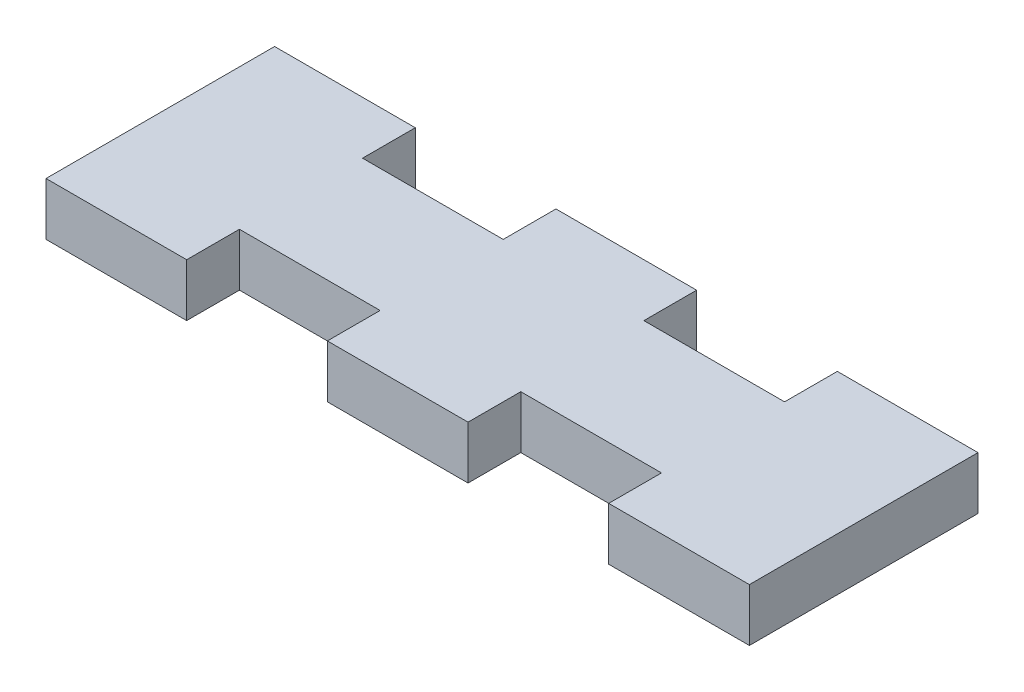
ISO-10303-21;
HEADER;
FILE_DESCRIPTION(('STEP AP214'),'2;1');
FILE_NAME('part.step','',(''),(''),'','','');
FILE_SCHEMA(('AUTOMOTIVE_DESIGN { 1 0 10303 214 1 1 1 1 }'));
ENDSEC;
DATA;
#1=APPLICATION_CONTEXT('core data for automotive mechanical design processes');
#2=APPLICATION_PROTOCOL_DEFINITION('international standard','automotive_design',2000,#1);
#3=PRODUCT_CONTEXT('',#1,'mechanical');
#4=PRODUCT('Part','Part','',(#3));
#5=PRODUCT_RELATED_PRODUCT_CATEGORY('part','',(#4));
#6=PRODUCT_DEFINITION_FORMATION('','',#4);
#7=PRODUCT_DEFINITION_CONTEXT('part definition',#1,'design');
#8=PRODUCT_DEFINITION('design','',#6,#7);
#9=PRODUCT_DEFINITION_SHAPE('','',#8);
#10=(LENGTH_UNIT() NAMED_UNIT(*) SI_UNIT(.MILLI.,.METRE.));
#11=(NAMED_UNIT(*) PLANE_ANGLE_UNIT() SI_UNIT($,.RADIAN.));
#12=(NAMED_UNIT(*) SI_UNIT($,.STERADIAN.) SOLID_ANGLE_UNIT());
#13=UNCERTAINTY_MEASURE_WITH_UNIT(LENGTH_MEASURE(1.E-05),#10,'distance_accuracy_value','');
#14=(GEOMETRIC_REPRESENTATION_CONTEXT(3) GLOBAL_UNCERTAINTY_ASSIGNED_CONTEXT((#13)) GLOBAL_UNIT_ASSIGNED_CONTEXT((#10,
#11,#12)) REPRESENTATION_CONTEXT('',''));
#15=CARTESIAN_POINT('',(0.,0.,0.));
#16=DIRECTION('',(0.,0.,1.));
#17=DIRECTION('',(1.,0.,0.));
#18=AXIS2_PLACEMENT_3D('',#15,#16,#17);
#19=CARTESIAN_POINT('',(12.,1.5,-6.5));
#20=DIRECTION('',(0.,0.,1.));
#21=DIRECTION('',(1.,0.,0.));
#22=AXIS2_PLACEMENT_3D('',#19,#20,#21);
#23=PLANE('',#22);
#24=DIRECTION('',(-1.,0.,0.));
#25=VECTOR('',#24,1.);
#26=CARTESIAN_POINT('',(12.,-1.5,-6.5));
#27=LINE('',#26,#25);
#28=CARTESIAN_POINT('',(20.,-1.5,-6.5));
#29=VERTEX_POINT('',#28);
#30=CARTESIAN_POINT('',(12.,-1.5,-6.5));
#31=VERTEX_POINT('',#30);
#32=EDGE_CURVE('E205',#29,#31,#27,.T.);
#33=ORIENTED_EDGE('',*,*,#32,.T.);
#34=DIRECTION('',(0.,-1.,0.));
#35=VECTOR('',#34,1.);
#36=CARTESIAN_POINT('',(12.,1.5,-6.5));
#37=LINE('',#36,#35);
#38=CARTESIAN_POINT('',(12.,1.5,-6.5));
#39=VERTEX_POINT('',#38);
#40=EDGE_CURVE('E40',#39,#31,#37,.T.);
#41=ORIENTED_EDGE('',*,*,#40,.F.);
#42=DIRECTION('',(-1.,0.,0.));
#43=VECTOR('',#42,1.);
#44=CARTESIAN_POINT('',(12.,1.5,-6.5));
#45=LINE('',#44,#43);
#46=CARTESIAN_POINT('',(20.,1.5,-6.5));
#47=VERTEX_POINT('',#46);
#48=EDGE_CURVE('E129',#47,#39,#45,.T.);
#49=ORIENTED_EDGE('',*,*,#48,.F.);
#50=DIRECTION('',(0.,-1.,0.));
#51=VECTOR('',#50,1.);
#52=CARTESIAN_POINT('',(20.,1.5,-6.5));
#53=LINE('',#52,#51);
#54=EDGE_CURVE('E11',#47,#29,#53,.T.);
#55=ORIENTED_EDGE('',*,*,#54,.T.);
#56=EDGE_LOOP('',(#33,#41,#49,#55));
#57=FACE_BOUND('',#56,.T.);
#58=ADVANCED_FACE('F32',(#57),#23,.F.);
#59=CARTESIAN_POINT('',(12.,1.5,-3.5));
#60=DIRECTION('',(1.,0.,0.));
#61=DIRECTION('',(0.,0.,-1.));
#62=AXIS2_PLACEMENT_3D('',#59,#60,#61);
#63=PLANE('',#62);
#64=DIRECTION('',(0.,0.,1.));
#65=VECTOR('',#64,1.);
#66=CARTESIAN_POINT('',(12.,-1.5,-3.5));
#67=LINE('',#66,#65);
#68=CARTESIAN_POINT('',(12.,-1.5,-3.5));
#69=VERTEX_POINT('',#68);
#70=EDGE_CURVE('E207',#31,#69,#67,.T.);
#71=ORIENTED_EDGE('',*,*,#70,.T.);
#72=DIRECTION('',(0.,-1.,0.));
#73=VECTOR('',#72,1.);
#74=CARTESIAN_POINT('',(12.,1.5,-3.5));
#75=LINE('',#74,#73);
#76=CARTESIAN_POINT('',(12.,1.5,-3.5));
#77=VERTEX_POINT('',#76);
#78=EDGE_CURVE('E285',#77,#69,#75,.T.);
#79=ORIENTED_EDGE('',*,*,#78,.F.);
#80=DIRECTION('',(0.,0.,1.));
#81=VECTOR('',#80,1.);
#82=CARTESIAN_POINT('',(12.,1.5,-3.5));
#83=LINE('',#82,#81);
#84=EDGE_CURVE('E293',#39,#77,#83,.T.);
#85=ORIENTED_EDGE('',*,*,#84,.F.);
#86=ORIENTED_EDGE('',*,*,#40,.T.);
#87=EDGE_LOOP('',(#71,#79,#85,#86));
#88=FACE_BOUND('',#87,.T.);
#89=ADVANCED_FACE('F291',(#88),#63,.F.);
#90=CARTESIAN_POINT('',(3.99999999999999,1.5,-3.5));
#91=DIRECTION('',(0.,0.,1.));
#92=DIRECTION('',(1.,0.,0.));
#93=AXIS2_PLACEMENT_3D('',#90,#91,#92);
#94=PLANE('',#93);
#95=DIRECTION('',(-1.,0.,0.));
#96=VECTOR('',#95,1.);
#97=CARTESIAN_POINT('',(3.99999999999999,-1.5,-3.5));
#98=LINE('',#97,#96);
#99=CARTESIAN_POINT('',(3.99999999999999,-1.5,-3.5));
#100=VERTEX_POINT('',#99);
#101=EDGE_CURVE('E209',#69,#100,#98,.T.);
#102=ORIENTED_EDGE('',*,*,#101,.T.);
#103=DIRECTION('',(0.,-1.,0.));
#104=VECTOR('',#103,1.);
#105=CARTESIAN_POINT('',(3.99999999999999,1.5,-3.5));
#106=LINE('',#105,#104);
#107=CARTESIAN_POINT('',(3.99999999999999,1.5,-3.5));
#108=VERTEX_POINT('',#107);
#109=EDGE_CURVE('E282',#108,#100,#106,.T.);
#110=ORIENTED_EDGE('',*,*,#109,.F.);
#111=DIRECTION('',(-1.,0.,0.));
#112=VECTOR('',#111,1.);
#113=CARTESIAN_POINT('',(3.99999999999999,1.5,-3.5));
#114=LINE('',#113,#112);
#115=EDGE_CURVE('E309',#77,#108,#114,.T.);
#116=ORIENTED_EDGE('',*,*,#115,.F.);
#117=ORIENTED_EDGE('',*,*,#78,.T.);
#118=EDGE_LOOP('',(#102,#110,#116,#117));
#119=FACE_BOUND('',#118,.T.);
#120=ADVANCED_FACE('F300',(#119),#94,.F.);
#121=CARTESIAN_POINT('',(3.99999999999999,1.5,-6.5));
#122=DIRECTION('',(-1.,0.,0.));
#123=DIRECTION('',(0.,0.,1.));
#124=AXIS2_PLACEMENT_3D('',#121,#122,#123);
#125=PLANE('',#124);
#126=DIRECTION('',(0.,0.,-1.));
#127=VECTOR('',#126,1.);
#128=CARTESIAN_POINT('',(3.99999999999999,-1.5,-6.5));
#129=LINE('',#128,#127);
#130=CARTESIAN_POINT('',(3.99999999999999,-1.5,-6.5));
#131=VERTEX_POINT('',#130);
#132=EDGE_CURVE('E211',#100,#131,#129,.T.);
#133=ORIENTED_EDGE('',*,*,#132,.T.);
#134=DIRECTION('',(0.,-1.,0.));
#135=VECTOR('',#134,1.);
#136=CARTESIAN_POINT('',(3.99999999999999,1.5,-6.5));
#137=LINE('',#136,#135);
#138=CARTESIAN_POINT('',(3.99999999999999,1.5,-6.5));
#139=VERTEX_POINT('',#138);
#140=EDGE_CURVE('E279',#139,#131,#137,.T.);
#141=ORIENTED_EDGE('',*,*,#140,.F.);
#142=DIRECTION('',(0.,0.,-1.));
#143=VECTOR('',#142,1.);
#144=CARTESIAN_POINT('',(3.99999999999999,1.5,-6.5));
#145=LINE('',#144,#143);
#146=EDGE_CURVE('E306',#108,#139,#145,.T.);
#147=ORIENTED_EDGE('',*,*,#146,.F.);
#148=ORIENTED_EDGE('',*,*,#109,.T.);
#149=EDGE_LOOP('',(#133,#141,#147,#148));
#150=FACE_BOUND('',#149,.T.);
#151=ADVANCED_FACE('F304',(#150),#125,.F.);
#152=CARTESIAN_POINT('',(-4.00000000000001,1.5,-6.5));
#153=DIRECTION('',(0.,0.,1.));
#154=DIRECTION('',(1.,0.,0.));
#155=AXIS2_PLACEMENT_3D('',#152,#153,#154);
#156=PLANE('',#155);
#157=DIRECTION('',(-1.,0.,0.));
#158=VECTOR('',#157,1.);
#159=CARTESIAN_POINT('',(-4.00000000000001,-1.5,-6.5));
#160=LINE('',#159,#158);
#161=CARTESIAN_POINT('',(-4.00000000000001,-1.5,-6.5));
#162=VERTEX_POINT('',#161);
#163=EDGE_CURVE('E213',#131,#162,#160,.T.);
#164=ORIENTED_EDGE('',*,*,#163,.T.);
#165=DIRECTION('',(0.,-1.,0.));
#166=VECTOR('',#165,1.);
#167=CARTESIAN_POINT('',(-4.00000000000001,1.5,-6.5));
#168=LINE('',#167,#166);
#169=CARTESIAN_POINT('',(-4.00000000000001,1.5,-6.5));
#170=VERTEX_POINT('',#169);
#171=EDGE_CURVE('E276',#170,#162,#168,.T.);
#172=ORIENTED_EDGE('',*,*,#171,.F.);
#173=DIRECTION('',(-1.,0.,0.));
#174=VECTOR('',#173,1.);
#175=CARTESIAN_POINT('',(-4.00000000000001,1.5,-6.5));
#176=LINE('',#175,#174);
#177=EDGE_CURVE('E308',#139,#170,#176,.T.);
#178=ORIENTED_EDGE('',*,*,#177,.F.);
#179=ORIENTED_EDGE('',*,*,#140,.T.);
#180=EDGE_LOOP('',(#164,#172,#178,#179));
#181=FACE_BOUND('',#180,.T.);
#182=ADVANCED_FACE('F359',(#181),#156,.F.);
#183=CARTESIAN_POINT('',(-4.00000000000001,1.5,-3.5));
#184=DIRECTION('',(1.,0.,0.));
#185=DIRECTION('',(0.,0.,-1.));
#186=AXIS2_PLACEMENT_3D('',#183,#184,#185);
#187=PLANE('',#186);
#188=DIRECTION('',(0.,0.,1.));
#189=VECTOR('',#188,1.);
#190=CARTESIAN_POINT('',(-4.00000000000001,-1.5,-3.5));
#191=LINE('',#190,#189);
#192=CARTESIAN_POINT('',(-4.00000000000001,-1.5,-3.5));
#193=VERTEX_POINT('',#192);
#194=EDGE_CURVE('E215',#162,#193,#191,.T.);
#195=ORIENTED_EDGE('',*,*,#194,.T.);
#196=DIRECTION('',(0.,-1.,0.));
#197=VECTOR('',#196,1.);
#198=CARTESIAN_POINT('',(-4.00000000000001,1.5,-3.5));
#199=LINE('',#198,#197);
#200=CARTESIAN_POINT('',(-4.00000000000001,1.5,-3.5));
#201=VERTEX_POINT('',#200);
#202=EDGE_CURVE('E273',#201,#193,#199,.T.);
#203=ORIENTED_EDGE('',*,*,#202,.F.);
#204=DIRECTION('',(0.,0.,1.));
#205=VECTOR('',#204,1.);
#206=CARTESIAN_POINT('',(-4.00000000000001,1.5,-3.5));
#207=LINE('',#206,#205);
#208=EDGE_CURVE('E311',#170,#201,#207,.T.);
#209=ORIENTED_EDGE('',*,*,#208,.F.);
#210=ORIENTED_EDGE('',*,*,#171,.T.);
#211=EDGE_LOOP('',(#195,#203,#209,#210));
#212=FACE_BOUND('',#211,.T.);
#213=ADVANCED_FACE('F362',(#212),#187,.F.);
#214=CARTESIAN_POINT('',(-12.,1.5,-3.5));
#215=DIRECTION('',(0.,0.,1.));
#216=DIRECTION('',(1.,0.,0.));
#217=AXIS2_PLACEMENT_3D('',#214,#215,#216);
#218=PLANE('',#217);
#219=DIRECTION('',(-1.,0.,0.));
#220=VECTOR('',#219,1.);
#221=CARTESIAN_POINT('',(-12.,-1.5,-3.5));
#222=LINE('',#221,#220);
#223=CARTESIAN_POINT('',(-12.,-1.5,-3.5));
#224=VERTEX_POINT('',#223);
#225=EDGE_CURVE('E217',#193,#224,#222,.T.);
#226=ORIENTED_EDGE('',*,*,#225,.T.);
#227=DIRECTION('',(0.,-1.,0.));
#228=VECTOR('',#227,1.);
#229=CARTESIAN_POINT('',(-12.,1.5,-3.5));
#230=LINE('',#229,#228);
#231=CARTESIAN_POINT('',(-12.,1.5,-3.5));
#232=VERTEX_POINT('',#231);
#233=EDGE_CURVE('E270',#232,#224,#230,.T.);
#234=ORIENTED_EDGE('',*,*,#233,.F.);
#235=DIRECTION('',(-1.,0.,0.));
#236=VECTOR('',#235,1.);
#237=CARTESIAN_POINT('',(-12.,1.5,-3.5));
#238=LINE('',#237,#236);
#239=EDGE_CURVE('E317',#201,#232,#238,.T.);
#240=ORIENTED_EDGE('',*,*,#239,.F.);
#241=ORIENTED_EDGE('',*,*,#202,.T.);
#242=EDGE_LOOP('',(#226,#234,#240,#241));
#243=FACE_BOUND('',#242,.T.);
#244=ADVANCED_FACE('F366',(#243),#218,.F.);
#245=CARTESIAN_POINT('',(-12.,1.5,-6.5));
#246=DIRECTION('',(-1.,0.,0.));
#247=DIRECTION('',(0.,0.,1.));
#248=AXIS2_PLACEMENT_3D('',#245,#246,#247);
#249=PLANE('',#248);
#250=DIRECTION('',(0.,0.,-1.));
#251=VECTOR('',#250,1.);
#252=CARTESIAN_POINT('',(-12.,-1.5,-6.5));
#253=LINE('',#252,#251);
#254=CARTESIAN_POINT('',(-12.,-1.5,-6.5));
#255=VERTEX_POINT('',#254);
#256=EDGE_CURVE('E219',#224,#255,#253,.T.);
#257=ORIENTED_EDGE('',*,*,#256,.T.);
#258=DIRECTION('',(0.,-1.,0.));
#259=VECTOR('',#258,1.);
#260=CARTESIAN_POINT('',(-12.,1.5,-6.5));
#261=LINE('',#260,#259);
#262=CARTESIAN_POINT('',(-12.,1.5,-6.5));
#263=VERTEX_POINT('',#262);
#264=EDGE_CURVE('E267',#263,#255,#261,.T.);
#265=ORIENTED_EDGE('',*,*,#264,.F.);
#266=DIRECTION('',(0.,0.,-1.));
#267=VECTOR('',#266,1.);
#268=CARTESIAN_POINT('',(-12.,1.5,-6.5));
#269=LINE('',#268,#267);
#270=EDGE_CURVE('E319',#232,#263,#269,.T.);
#271=ORIENTED_EDGE('',*,*,#270,.F.);
#272=ORIENTED_EDGE('',*,*,#233,.T.);
#273=EDGE_LOOP('',(#257,#265,#271,#272));
#274=FACE_BOUND('',#273,.T.);
#275=ADVANCED_FACE('F370',(#274),#249,.F.);
#276=CARTESIAN_POINT('',(-20.,1.5,-6.5));
#277=DIRECTION('',(0.,0.,1.));
#278=DIRECTION('',(1.,0.,0.));
#279=AXIS2_PLACEMENT_3D('',#276,#277,#278);
#280=PLANE('',#279);
#281=DIRECTION('',(-1.,0.,0.));
#282=VECTOR('',#281,1.);
#283=CARTESIAN_POINT('',(-20.,-1.5,-6.5));
#284=LINE('',#283,#282);
#285=CARTESIAN_POINT('',(-20.,-1.5,-6.5));
#286=VERTEX_POINT('',#285);
#287=EDGE_CURVE('E221',#255,#286,#284,.T.);
#288=ORIENTED_EDGE('',*,*,#287,.T.);
#289=DIRECTION('',(0.,-1.,0.));
#290=VECTOR('',#289,1.);
#291=CARTESIAN_POINT('',(-20.,1.5,-6.5));
#292=LINE('',#291,#290);
#293=CARTESIAN_POINT('',(-20.,1.5,-6.5));
#294=VERTEX_POINT('',#293);
#295=EDGE_CURVE('E264',#294,#286,#292,.T.);
#296=ORIENTED_EDGE('',*,*,#295,.F.);
#297=DIRECTION('',(-1.,0.,0.));
#298=VECTOR('',#297,1.);
#299=CARTESIAN_POINT('',(-20.,1.5,-6.5));
#300=LINE('',#299,#298);
#301=EDGE_CURVE('E321',#263,#294,#300,.T.);
#302=ORIENTED_EDGE('',*,*,#301,.F.);
#303=ORIENTED_EDGE('',*,*,#264,.T.);
#304=EDGE_LOOP('',(#288,#296,#302,#303));
#305=FACE_BOUND('',#304,.T.);
#306=ADVANCED_FACE('F374',(#305),#280,.F.);
#307=CARTESIAN_POINT('',(-20.,1.5,3.5));
#308=DIRECTION('',(1.,0.,0.));
#309=DIRECTION('',(0.,0.,-1.));
#310=AXIS2_PLACEMENT_3D('',#307,#308,#309);
#311=PLANE('',#310);
#312=DIRECTION('',(0.,0.,1.));
#313=VECTOR('',#312,1.);
#314=CARTESIAN_POINT('',(-20.,-1.5,3.5));
#315=LINE('',#314,#313);
#316=CARTESIAN_POINT('',(-20.,-1.5,6.5));
#317=VERTEX_POINT('',#316);
#318=EDGE_CURVE('E224',#286,#317,#315,.T.);
#319=ORIENTED_EDGE('',*,*,#318,.T.);
#320=DIRECTION('',(0.,-1.,0.));
#321=VECTOR('',#320,1.);
#322=CARTESIAN_POINT('',(-20.,1.5,6.5));
#323=LINE('',#322,#321);
#324=CARTESIAN_POINT('',(-20.,1.5,6.5));
#325=VERTEX_POINT('',#324);
#326=EDGE_CURVE('E261',#325,#317,#323,.T.);
#327=ORIENTED_EDGE('',*,*,#326,.F.);
#328=DIRECTION('',(0.,0.,1.));
#329=VECTOR('',#328,1.);
#330=CARTESIAN_POINT('',(-20.,1.5,-3.5));
#331=LINE('',#330,#329);
#332=EDGE_CURVE('E323',#294,#325,#331,.T.);
#333=ORIENTED_EDGE('',*,*,#332,.F.);
#334=ORIENTED_EDGE('',*,*,#295,.T.);
#335=EDGE_LOOP('',(#319,#327,#333,#334));
#336=FACE_BOUND('',#335,.T.);
#337=ADVANCED_FACE('F378',(#336),#311,.F.);
#338=CARTESIAN_POINT('',(-20.,1.5,6.5));
#339=DIRECTION('',(0.,0.,-1.));
#340=DIRECTION('',(-1.,0.,0.));
#341=AXIS2_PLACEMENT_3D('',#338,#339,#340);
#342=PLANE('',#341);
#343=DIRECTION('',(1.,0.,0.));
#344=VECTOR('',#343,1.);
#345=CARTESIAN_POINT('',(-20.,-1.5,6.5));
#346=LINE('',#345,#344);
#347=CARTESIAN_POINT('',(-12.,-1.5,6.5));
#348=VERTEX_POINT('',#347);
#349=EDGE_CURVE('E226',#317,#348,#346,.T.);
#350=ORIENTED_EDGE('',*,*,#349,.T.);
#351=DIRECTION('',(0.,-1.,0.));
#352=VECTOR('',#351,1.);
#353=CARTESIAN_POINT('',(-12.,1.5,6.5));
#354=LINE('',#353,#352);
#355=CARTESIAN_POINT('',(-12.,1.5,6.5));
#356=VERTEX_POINT('',#355);
#357=EDGE_CURVE('E258',#356,#348,#354,.T.);
#358=ORIENTED_EDGE('',*,*,#357,.F.);
#359=DIRECTION('',(1.,0.,0.));
#360=VECTOR('',#359,1.);
#361=CARTESIAN_POINT('',(-20.,1.5,6.5));
#362=LINE('',#361,#360);
#363=EDGE_CURVE('E325',#325,#356,#362,.T.);
#364=ORIENTED_EDGE('',*,*,#363,.F.);
#365=ORIENTED_EDGE('',*,*,#326,.T.);
#366=EDGE_LOOP('',(#350,#358,#364,#365));
#367=FACE_BOUND('',#366,.T.);
#368=ADVANCED_FACE('F382',(#367),#342,.F.);
#369=CARTESIAN_POINT('',(-12.,1.5,6.5));
#370=DIRECTION('',(-1.,0.,0.));
#371=DIRECTION('',(0.,0.,1.));
#372=AXIS2_PLACEMENT_3D('',#369,#370,#371);
#373=PLANE('',#372);
#374=DIRECTION('',(0.,0.,-1.));
#375=VECTOR('',#374,1.);
#376=CARTESIAN_POINT('',(-12.,-1.5,6.5));
#377=LINE('',#376,#375);
#378=CARTESIAN_POINT('',(-12.,-1.5,3.5));
#379=VERTEX_POINT('',#378);
#380=EDGE_CURVE('E228',#348,#379,#377,.T.);
#381=ORIENTED_EDGE('',*,*,#380,.T.);
#382=DIRECTION('',(0.,-1.,0.));
#383=VECTOR('',#382,1.);
#384=CARTESIAN_POINT('',(-12.,1.5,3.5));
#385=LINE('',#384,#383);
#386=CARTESIAN_POINT('',(-12.,1.5,3.5));
#387=VERTEX_POINT('',#386);
#388=EDGE_CURVE('E255',#387,#379,#385,.T.);
#389=ORIENTED_EDGE('',*,*,#388,.F.);
#390=DIRECTION('',(0.,0.,-1.));
#391=VECTOR('',#390,1.);
#392=CARTESIAN_POINT('',(-12.,1.5,6.5));
#393=LINE('',#392,#391);
#394=EDGE_CURVE('E327',#356,#387,#393,.T.);
#395=ORIENTED_EDGE('',*,*,#394,.F.);
#396=ORIENTED_EDGE('',*,*,#357,.T.);
#397=EDGE_LOOP('',(#381,#389,#395,#396));
#398=FACE_BOUND('',#397,.T.);
#399=ADVANCED_FACE('F386',(#398),#373,.F.);
#400=CARTESIAN_POINT('',(-12.,1.5,3.5));
#401=DIRECTION('',(0.,0.,-1.));
#402=DIRECTION('',(-1.,0.,0.));
#403=AXIS2_PLACEMENT_3D('',#400,#401,#402);
#404=PLANE('',#403);
#405=DIRECTION('',(1.,0.,0.));
#406=VECTOR('',#405,1.);
#407=CARTESIAN_POINT('',(-12.,-1.5,3.5));
#408=LINE('',#407,#406);
#409=CARTESIAN_POINT('',(-4.00000000000001,-1.5,3.5));
#410=VERTEX_POINT('',#409);
#411=EDGE_CURVE('E230',#379,#410,#408,.T.);
#412=ORIENTED_EDGE('',*,*,#411,.T.);
#413=DIRECTION('',(0.,-1.,0.));
#414=VECTOR('',#413,1.);
#415=CARTESIAN_POINT('',(-4.00000000000001,1.5,3.5));
#416=LINE('',#415,#414);
#417=CARTESIAN_POINT('',(-4.00000000000001,1.5,3.5));
#418=VERTEX_POINT('',#417);
#419=EDGE_CURVE('E252',#418,#410,#416,.T.);
#420=ORIENTED_EDGE('',*,*,#419,.F.);
#421=DIRECTION('',(1.,0.,0.));
#422=VECTOR('',#421,1.);
#423=CARTESIAN_POINT('',(-12.,1.5,3.5));
#424=LINE('',#423,#422);
#425=EDGE_CURVE('E329',#387,#418,#424,.T.);
#426=ORIENTED_EDGE('',*,*,#425,.F.);
#427=ORIENTED_EDGE('',*,*,#388,.T.);
#428=EDGE_LOOP('',(#412,#420,#426,#427));
#429=FACE_BOUND('',#428,.T.);
#430=ADVANCED_FACE('F390',(#429),#404,.F.);
#431=CARTESIAN_POINT('',(-4.00000000000001,1.5,3.5));
#432=DIRECTION('',(1.,0.,0.));
#433=DIRECTION('',(0.,0.,-1.));
#434=AXIS2_PLACEMENT_3D('',#431,#432,#433);
#435=PLANE('',#434);
#436=DIRECTION('',(0.,0.,1.));
#437=VECTOR('',#436,1.);
#438=CARTESIAN_POINT('',(-4.00000000000001,-1.5,3.5));
#439=LINE('',#438,#437);
#440=CARTESIAN_POINT('',(-4.00000000000001,-1.5,6.5));
#441=VERTEX_POINT('',#440);
#442=EDGE_CURVE('E232',#410,#441,#439,.T.);
#443=ORIENTED_EDGE('',*,*,#442,.T.);
#444=DIRECTION('',(0.,-1.,0.));
#445=VECTOR('',#444,1.);
#446=CARTESIAN_POINT('',(-4.00000000000001,1.5,6.5));
#447=LINE('',#446,#445);
#448=CARTESIAN_POINT('',(-4.00000000000001,1.5,6.5));
#449=VERTEX_POINT('',#448);
#450=EDGE_CURVE('E249',#449,#441,#447,.T.);
#451=ORIENTED_EDGE('',*,*,#450,.F.);
#452=DIRECTION('',(0.,0.,1.));
#453=VECTOR('',#452,1.);
#454=CARTESIAN_POINT('',(-4.00000000000001,1.5,3.5));
#455=LINE('',#454,#453);
#456=EDGE_CURVE('E331',#418,#449,#455,.T.);
#457=ORIENTED_EDGE('',*,*,#456,.F.);
#458=ORIENTED_EDGE('',*,*,#419,.T.);
#459=EDGE_LOOP('',(#443,#451,#457,#458));
#460=FACE_BOUND('',#459,.T.);
#461=ADVANCED_FACE('F394',(#460),#435,.F.);
#462=CARTESIAN_POINT('',(-4.00000000000001,1.5,6.5));
#463=DIRECTION('',(0.,0.,-1.));
#464=DIRECTION('',(-1.,0.,0.));
#465=AXIS2_PLACEMENT_3D('',#462,#463,#464);
#466=PLANE('',#465);
#467=DIRECTION('',(1.,0.,0.));
#468=VECTOR('',#467,1.);
#469=CARTESIAN_POINT('',(-4.00000000000001,-1.5,6.5));
#470=LINE('',#469,#468);
#471=CARTESIAN_POINT('',(3.99999999999999,-1.5,6.5));
#472=VERTEX_POINT('',#471);
#473=EDGE_CURVE('E234',#441,#472,#470,.T.);
#474=ORIENTED_EDGE('',*,*,#473,.T.);
#475=DIRECTION('',(0.,-1.,0.));
#476=VECTOR('',#475,1.);
#477=CARTESIAN_POINT('',(3.99999999999999,1.5,6.5));
#478=LINE('',#477,#476);
#479=CARTESIAN_POINT('',(3.99999999999999,1.5,6.5));
#480=VERTEX_POINT('',#479);
#481=EDGE_CURVE('E246',#480,#472,#478,.T.);
#482=ORIENTED_EDGE('',*,*,#481,.F.);
#483=DIRECTION('',(1.,0.,0.));
#484=VECTOR('',#483,1.);
#485=CARTESIAN_POINT('',(-4.00000000000001,1.5,6.5));
#486=LINE('',#485,#484);
#487=EDGE_CURVE('E333',#449,#480,#486,.T.);
#488=ORIENTED_EDGE('',*,*,#487,.F.);
#489=ORIENTED_EDGE('',*,*,#450,.T.);
#490=EDGE_LOOP('',(#474,#482,#488,#489));
#491=FACE_BOUND('',#490,.T.);
#492=ADVANCED_FACE('F339',(#491),#466,.F.);
#493=CARTESIAN_POINT('',(3.99999999999999,1.5,6.5));
#494=DIRECTION('',(-1.,0.,0.));
#495=DIRECTION('',(0.,0.,1.));
#496=AXIS2_PLACEMENT_3D('',#493,#494,#495);
#497=PLANE('',#496);
#498=DIRECTION('',(0.,0.,-1.));
#499=VECTOR('',#498,1.);
#500=CARTESIAN_POINT('',(3.99999999999999,-1.5,6.5));
#501=LINE('',#500,#499);
#502=CARTESIAN_POINT('',(3.99999999999999,-1.5,3.5));
#503=VERTEX_POINT('',#502);
#504=EDGE_CURVE('E236',#472,#503,#501,.T.);
#505=ORIENTED_EDGE('',*,*,#504,.T.);
#506=DIRECTION('',(0.,-1.,0.));
#507=VECTOR('',#506,1.);
#508=CARTESIAN_POINT('',(3.99999999999999,1.5,3.5));
#509=LINE('',#508,#507);
#510=CARTESIAN_POINT('',(3.99999999999999,1.5,3.5));
#511=VERTEX_POINT('',#510);
#512=EDGE_CURVE('E194',#511,#503,#509,.T.);
#513=ORIENTED_EDGE('',*,*,#512,.F.);
#514=DIRECTION('',(0.,0.,-1.));
#515=VECTOR('',#514,1.);
#516=CARTESIAN_POINT('',(3.99999999999999,1.5,6.5));
#517=LINE('',#516,#515);
#518=EDGE_CURVE('E185',#480,#511,#517,.T.);
#519=ORIENTED_EDGE('',*,*,#518,.F.);
#520=ORIENTED_EDGE('',*,*,#481,.T.);
#521=EDGE_LOOP('',(#505,#513,#519,#520));
#522=FACE_BOUND('',#521,.T.);
#523=ADVANCED_FACE('F343',(#522),#497,.F.);
#524=CARTESIAN_POINT('',(3.99999999999999,1.5,3.5));
#525=DIRECTION('',(0.,0.,-1.));
#526=DIRECTION('',(-1.,0.,0.));
#527=AXIS2_PLACEMENT_3D('',#524,#525,#526);
#528=PLANE('',#527);
#529=DIRECTION('',(1.,0.,0.));
#530=VECTOR('',#529,1.);
#531=CARTESIAN_POINT('',(3.99999999999999,-1.5,3.5));
#532=LINE('',#531,#530);
#533=CARTESIAN_POINT('',(12.,-1.5,3.5));
#534=VERTEX_POINT('',#533);
#535=EDGE_CURVE('E193',#503,#534,#532,.T.);
#536=ORIENTED_EDGE('',*,*,#535,.T.);
#537=DIRECTION('',(0.,-1.,0.));
#538=VECTOR('',#537,1.);
#539=CARTESIAN_POINT('',(12.,1.5,3.5));
#540=LINE('',#539,#538);
#541=CARTESIAN_POINT('',(12.,1.5,3.5));
#542=VERTEX_POINT('',#541);
#543=EDGE_CURVE('E190',#542,#534,#540,.T.);
#544=ORIENTED_EDGE('',*,*,#543,.F.);
#545=DIRECTION('',(1.,0.,0.));
#546=VECTOR('',#545,1.);
#547=CARTESIAN_POINT('',(3.99999999999999,1.5,3.5));
#548=LINE('',#547,#546);
#549=EDGE_CURVE('E179',#511,#542,#548,.T.);
#550=ORIENTED_EDGE('',*,*,#549,.F.);
#551=ORIENTED_EDGE('',*,*,#512,.T.);
#552=EDGE_LOOP('',(#536,#544,#550,#551));
#553=FACE_BOUND('',#552,.T.);
#554=ADVANCED_FACE('F191',(#553),#528,.F.);
#555=CARTESIAN_POINT('',(12.,1.5,3.5));
#556=DIRECTION('',(1.,0.,0.));
#557=DIRECTION('',(0.,0.,-1.));
#558=AXIS2_PLACEMENT_3D('',#555,#556,#557);
#559=PLANE('',#558);
#560=DIRECTION('',(0.,0.,1.));
#561=VECTOR('',#560,1.);
#562=CARTESIAN_POINT('',(12.,-1.5,3.5));
#563=LINE('',#562,#561);
#564=CARTESIAN_POINT('',(12.,-1.5,6.5));
#565=VERTEX_POINT('',#564);
#566=EDGE_CURVE('E114',#534,#565,#563,.T.);
#567=ORIENTED_EDGE('',*,*,#566,.T.);
#568=DIRECTION('',(0.,-1.,0.));
#569=VECTOR('',#568,1.);
#570=CARTESIAN_POINT('',(12.,1.5,6.5));
#571=LINE('',#570,#569);
#572=CARTESIAN_POINT('',(12.,1.5,6.5));
#573=VERTEX_POINT('',#572);
#574=EDGE_CURVE('E195',#573,#565,#571,.T.);
#575=ORIENTED_EDGE('',*,*,#574,.F.);
#576=DIRECTION('',(0.,0.,1.));
#577=VECTOR('',#576,1.);
#578=CARTESIAN_POINT('',(12.,1.5,3.5));
#579=LINE('',#578,#577);
#580=EDGE_CURVE('E183',#542,#573,#579,.T.);
#581=ORIENTED_EDGE('',*,*,#580,.F.);
#582=ORIENTED_EDGE('',*,*,#543,.T.);
#583=EDGE_LOOP('',(#567,#575,#581,#582));
#584=FACE_BOUND('',#583,.T.);
#585=ADVANCED_FACE('F197',(#584),#559,.F.);
#586=CARTESIAN_POINT('',(12.,1.5,6.5));
#587=DIRECTION('',(0.,0.,-1.));
#588=DIRECTION('',(-1.,0.,0.));
#589=AXIS2_PLACEMENT_3D('',#586,#587,#588);
#590=PLANE('',#589);
#591=DIRECTION('',(1.,0.,0.));
#592=VECTOR('',#591,1.);
#593=CARTESIAN_POINT('',(12.,-1.5,6.5));
#594=LINE('',#593,#592);
#595=CARTESIAN_POINT('',(20.,-1.5,6.5));
#596=VERTEX_POINT('',#595);
#597=EDGE_CURVE('E240',#565,#596,#594,.T.);
#598=ORIENTED_EDGE('',*,*,#597,.T.);
#599=DIRECTION('',(0.,-1.,0.));
#600=VECTOR('',#599,1.);
#601=CARTESIAN_POINT('',(20.,1.5,6.5));
#602=LINE('',#601,#600);
#603=CARTESIAN_POINT('',(20.,1.5,6.5));
#604=VERTEX_POINT('',#603);
#605=EDGE_CURVE('E201',#604,#596,#602,.T.);
#606=ORIENTED_EDGE('',*,*,#605,.F.);
#607=DIRECTION('',(1.,0.,0.));
#608=VECTOR('',#607,1.);
#609=CARTESIAN_POINT('',(12.,1.5,6.5));
#610=LINE('',#609,#608);
#611=EDGE_CURVE('E199',#573,#604,#610,.T.);
#612=ORIENTED_EDGE('',*,*,#611,.F.);
#613=ORIENTED_EDGE('',*,*,#574,.T.);
#614=EDGE_LOOP('',(#598,#606,#612,#613));
#615=FACE_BOUND('',#614,.T.);
#616=ADVANCED_FACE('F346',(#615),#590,.F.);
#617=CARTESIAN_POINT('',(20.,1.5,3.5));
#618=DIRECTION('',(-1.,0.,0.));
#619=DIRECTION('',(0.,0.,1.));
#620=AXIS2_PLACEMENT_3D('',#617,#618,#619);
#621=PLANE('',#620);
#622=DIRECTION('',(0.,0.,-1.));
#623=VECTOR('',#622,1.);
#624=CARTESIAN_POINT('',(20.,-1.5,3.5));
#625=LINE('',#624,#623);
#626=EDGE_CURVE('E121',#596,#29,#625,.T.);
#627=ORIENTED_EDGE('',*,*,#626,.T.);
#628=ORIENTED_EDGE('',*,*,#54,.F.);
#629=DIRECTION('',(0.,0.,-1.));
#630=VECTOR('',#629,1.);
#631=CARTESIAN_POINT('',(20.,1.5,-6.5));
#632=LINE('',#631,#630);
#633=EDGE_CURVE('E48',#604,#47,#632,.T.);
#634=ORIENTED_EDGE('',*,*,#633,.F.);
#635=ORIENTED_EDGE('',*,*,#605,.T.);
#636=EDGE_LOOP('',(#627,#628,#634,#635));
#637=FACE_BOUND('',#636,.T.);
#638=ADVANCED_FACE('F347',(#637),#621,.F.);
#639=CARTESIAN_POINT('',(0.,1.5,0.));
#640=DIRECTION('',(0.,1.,0.));
#641=DIRECTION('',(0.,0.,1.));
#642=AXIS2_PLACEMENT_3D('',#639,#640,#641);
#643=PLANE('',#642);
#644=ORIENTED_EDGE('',*,*,#633,.T.);
#645=ORIENTED_EDGE('',*,*,#48,.T.);
#646=ORIENTED_EDGE('',*,*,#84,.T.);
#647=ORIENTED_EDGE('',*,*,#115,.T.);
#648=ORIENTED_EDGE('',*,*,#146,.T.);
#649=ORIENTED_EDGE('',*,*,#177,.T.);
#650=ORIENTED_EDGE('',*,*,#208,.T.);
#651=ORIENTED_EDGE('',*,*,#239,.T.);
#652=ORIENTED_EDGE('',*,*,#270,.T.);
#653=ORIENTED_EDGE('',*,*,#301,.T.);
#654=ORIENTED_EDGE('',*,*,#332,.T.);
#655=ORIENTED_EDGE('',*,*,#363,.T.);
#656=ORIENTED_EDGE('',*,*,#394,.T.);
#657=ORIENTED_EDGE('',*,*,#425,.T.);
#658=ORIENTED_EDGE('',*,*,#456,.T.);
#659=ORIENTED_EDGE('',*,*,#487,.T.);
#660=ORIENTED_EDGE('',*,*,#518,.T.);
#661=ORIENTED_EDGE('',*,*,#549,.T.);
#662=ORIENTED_EDGE('',*,*,#580,.T.);
#663=ORIENTED_EDGE('',*,*,#611,.T.);
#664=EDGE_LOOP('',(#644,#645,#646,#647,#648,#649,#650,#651,#652,#653,#654,#655,#656,#657,#658,
#659,#660,#661,#662,#663));
#665=FACE_BOUND('',#664,.T.);
#666=ADVANCED_FACE('F181',(#665),#643,.T.);
#667=CARTESIAN_POINT('',(0.,-1.5,0.));
#668=DIRECTION('',(0.,1.,0.));
#669=DIRECTION('',(0.,0.,1.));
#670=AXIS2_PLACEMENT_3D('',#667,#668,#669);
#671=PLANE('',#670);
#672=ORIENTED_EDGE('',*,*,#32,.F.);
#673=ORIENTED_EDGE('',*,*,#626,.F.);
#674=ORIENTED_EDGE('',*,*,#597,.F.);
#675=ORIENTED_EDGE('',*,*,#566,.F.);
#676=ORIENTED_EDGE('',*,*,#535,.F.);
#677=ORIENTED_EDGE('',*,*,#504,.F.);
#678=ORIENTED_EDGE('',*,*,#473,.F.);
#679=ORIENTED_EDGE('',*,*,#442,.F.);
#680=ORIENTED_EDGE('',*,*,#411,.F.);
#681=ORIENTED_EDGE('',*,*,#380,.F.);
#682=ORIENTED_EDGE('',*,*,#349,.F.);
#683=ORIENTED_EDGE('',*,*,#318,.F.);
#684=ORIENTED_EDGE('',*,*,#287,.F.);
#685=ORIENTED_EDGE('',*,*,#256,.F.);
#686=ORIENTED_EDGE('',*,*,#225,.F.);
#687=ORIENTED_EDGE('',*,*,#194,.F.);
#688=ORIENTED_EDGE('',*,*,#163,.F.);
#689=ORIENTED_EDGE('',*,*,#132,.F.);
#690=ORIENTED_EDGE('',*,*,#101,.F.);
#691=ORIENTED_EDGE('',*,*,#70,.F.);
#692=EDGE_LOOP('',(#672,#673,#674,#675,#676,#677,#678,#679,#680,#681,#682,#683,#684,#685,#686,
#687,#688,#689,#690,#691));
#693=FACE_BOUND('',#692,.T.);
#694=ADVANCED_FACE('F295',(#693),#671,.F.);
#695=CLOSED_SHELL('',(#58,#89,#120,#151,#182,#213,#244,#275,#306,#337,#368,#399,#430,#461,#492,
#523,#554,#585,#616,#638,#666,#694));
#696=MANIFOLD_SOLID_BREP('B2',#695);
#697=ADVANCED_BREP_SHAPE_REPRESENTATION('',(#18,#696),#14);
#698=SHAPE_DEFINITION_REPRESENTATION(#9,#697);
ENDSEC;
END-ISO-10303-21;
